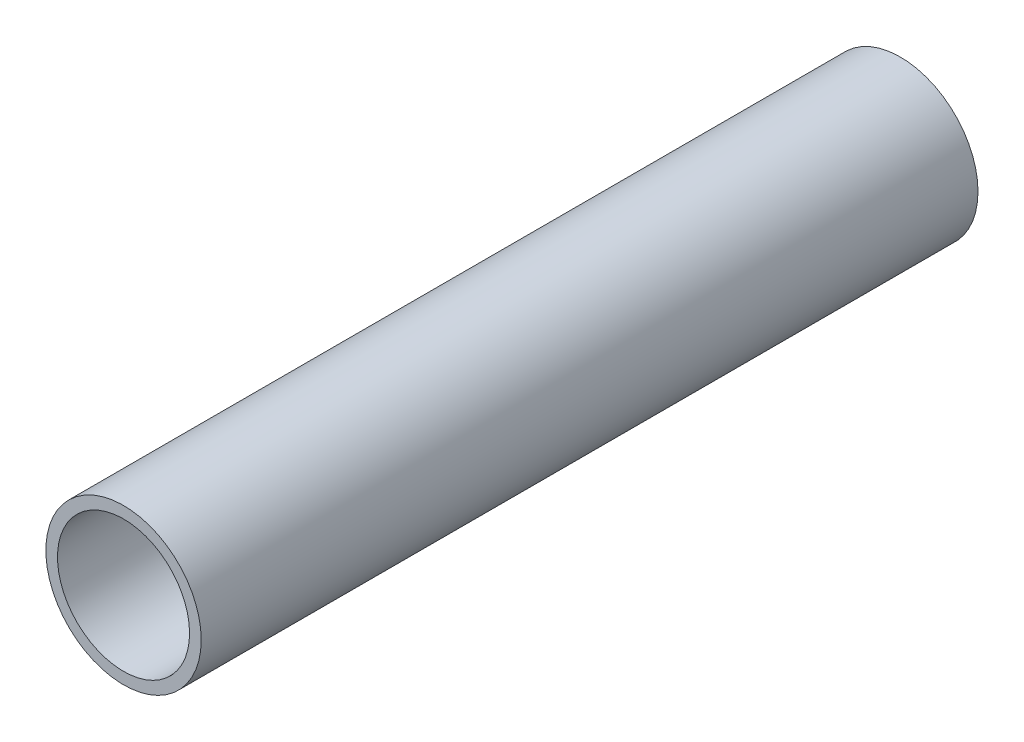
ISO-10303-21;
HEADER;
FILE_DESCRIPTION(('STEP AP214'),'2;1');
FILE_NAME('part.step','',(''),(''),'','','');
FILE_SCHEMA(('AUTOMOTIVE_DESIGN { 1 0 10303 214 1 1 1 1 }'));
ENDSEC;
DATA;
#1=APPLICATION_CONTEXT('core data for automotive mechanical design processes');
#2=APPLICATION_PROTOCOL_DEFINITION('international standard','automotive_design',2000,#1);
#3=PRODUCT_CONTEXT('',#1,'mechanical');
#4=PRODUCT('Part','Part','',(#3));
#5=PRODUCT_RELATED_PRODUCT_CATEGORY('part','',(#4));
#6=PRODUCT_DEFINITION_FORMATION('','',#4);
#7=PRODUCT_DEFINITION_CONTEXT('part definition',#1,'design');
#8=PRODUCT_DEFINITION('design','',#6,#7);
#9=PRODUCT_DEFINITION_SHAPE('','',#8);
#10=(LENGTH_UNIT() NAMED_UNIT(*) SI_UNIT(.MILLI.,.METRE.));
#11=(NAMED_UNIT(*) PLANE_ANGLE_UNIT() SI_UNIT($,.RADIAN.));
#12=(NAMED_UNIT(*) SI_UNIT($,.STERADIAN.) SOLID_ANGLE_UNIT());
#13=UNCERTAINTY_MEASURE_WITH_UNIT(LENGTH_MEASURE(1.E-05),#10,'distance_accuracy_value','');
#14=(GEOMETRIC_REPRESENTATION_CONTEXT(3) GLOBAL_UNCERTAINTY_ASSIGNED_CONTEXT((#13)) GLOBAL_UNIT_ASSIGNED_CONTEXT((#10,
#11,#12)) REPRESENTATION_CONTEXT('',''));
#15=CARTESIAN_POINT('',(0.,0.,0.));
#16=DIRECTION('',(0.,0.,1.));
#17=DIRECTION('',(1.,0.,0.));
#18=AXIS2_PLACEMENT_3D('',#15,#16,#17);
#19=CARTESIAN_POINT('',(0.,0.,300.));
#20=DIRECTION('',(0.,0.,1.));
#21=DIRECTION('',(1.,0.,0.));
#22=AXIS2_PLACEMENT_3D('',#19,#20,#21);
#23=PLANE('',#22);
#24=CARTESIAN_POINT('',(0.,0.,300.));
#25=DIRECTION('',(0.,0.,1.));
#26=DIRECTION('',(1.,0.,0.));
#27=AXIS2_PLACEMENT_3D('',#24,#25,#26);
#28=CIRCLE('',#27,30.);
#29=CARTESIAN_POINT('',(30.,0.,300.));
#30=VERTEX_POINT('',#29);
#31=EDGE_CURVE('E10',#30,#30,#28,.T.);
#32=ORIENTED_EDGE('',*,*,#31,.T.);
#33=EDGE_LOOP('',(#32));
#34=FACE_BOUND('',#33,.T.);
#35=CARTESIAN_POINT('',(0.,0.,300.));
#36=DIRECTION('',(0.,0.,1.));
#37=DIRECTION('',(1.,0.,0.));
#38=AXIS2_PLACEMENT_3D('',#35,#36,#37);
#39=CIRCLE('',#38,25.5);
#40=CARTESIAN_POINT('',(25.5,0.,300.));
#41=VERTEX_POINT('',#40);
#42=EDGE_CURVE('E46',#41,#41,#39,.T.);
#43=ORIENTED_EDGE('',*,*,#42,.F.);
#44=EDGE_LOOP('',(#43));
#45=FACE_BOUND('',#44,.T.);
#46=ADVANCED_FACE('F35',(#34,#45),#23,.T.);
#47=CARTESIAN_POINT('',(0.,0.,0.));
#48=DIRECTION('',(0.,0.,1.));
#49=DIRECTION('',(1.,0.,0.));
#50=AXIS2_PLACEMENT_3D('',#47,#48,#49);
#51=PLANE('',#50);
#52=CARTESIAN_POINT('',(0.,0.,0.));
#53=DIRECTION('',(0.,0.,1.));
#54=DIRECTION('',(1.,0.,0.));
#55=AXIS2_PLACEMENT_3D('',#52,#53,#54);
#56=CIRCLE('',#55,30.);
#57=CARTESIAN_POINT('',(30.,0.,0.));
#58=VERTEX_POINT('',#57);
#59=EDGE_CURVE('E39',#58,#58,#56,.T.);
#60=ORIENTED_EDGE('',*,*,#59,.F.);
#61=EDGE_LOOP('',(#60));
#62=FACE_BOUND('',#61,.T.);
#63=CARTESIAN_POINT('',(0.,0.,0.));
#64=DIRECTION('',(0.,0.,1.));
#65=DIRECTION('',(1.,0.,0.));
#66=AXIS2_PLACEMENT_3D('',#63,#64,#65);
#67=CIRCLE('',#66,25.5);
#68=CARTESIAN_POINT('',(25.5,0.,0.));
#69=VERTEX_POINT('',#68);
#70=EDGE_CURVE('E48',#69,#69,#67,.T.);
#71=ORIENTED_EDGE('',*,*,#70,.T.);
#72=EDGE_LOOP('',(#71));
#73=FACE_BOUND('',#72,.T.);
#74=ADVANCED_FACE('F58',(#62,#73),#51,.F.);
#75=CARTESIAN_POINT('',(0.,0.,300.));
#76=DIRECTION('',(0.,0.,-1.));
#77=DIRECTION('',(-1.,0.,0.));
#78=AXIS2_PLACEMENT_3D('',#75,#76,#77);
#79=CYLINDRICAL_SURFACE('',#78,30.);
#80=ORIENTED_EDGE('',*,*,#31,.F.);
#81=EDGE_LOOP('',(#80));
#82=FACE_BOUND('',#81,.T.);
#83=ORIENTED_EDGE('',*,*,#59,.T.);
#84=EDGE_LOOP('',(#83));
#85=FACE_BOUND('',#84,.T.);
#86=ADVANCED_FACE('F37',(#82,#85),#79,.T.);
#87=CARTESIAN_POINT('',(0.,0.,300.));
#88=DIRECTION('',(0.,0.,-1.));
#89=DIRECTION('',(-1.,0.,0.));
#90=AXIS2_PLACEMENT_3D('',#87,#88,#89);
#91=CYLINDRICAL_SURFACE('',#90,25.5);
#92=ORIENTED_EDGE('',*,*,#42,.T.);
#93=EDGE_LOOP('',(#92));
#94=FACE_BOUND('',#93,.T.);
#95=ORIENTED_EDGE('',*,*,#70,.F.);
#96=EDGE_LOOP('',(#95));
#97=FACE_BOUND('',#96,.T.);
#98=ADVANCED_FACE('F54',(#94,#97),#91,.F.);
#99=CLOSED_SHELL('',(#46,#74,#86,#98));
#100=MANIFOLD_SOLID_BREP('B2',#99);
#101=ADVANCED_BREP_SHAPE_REPRESENTATION('',(#18,#100),#14);
#102=SHAPE_DEFINITION_REPRESENTATION(#9,#101);
ENDSEC;
END-ISO-10303-21;
